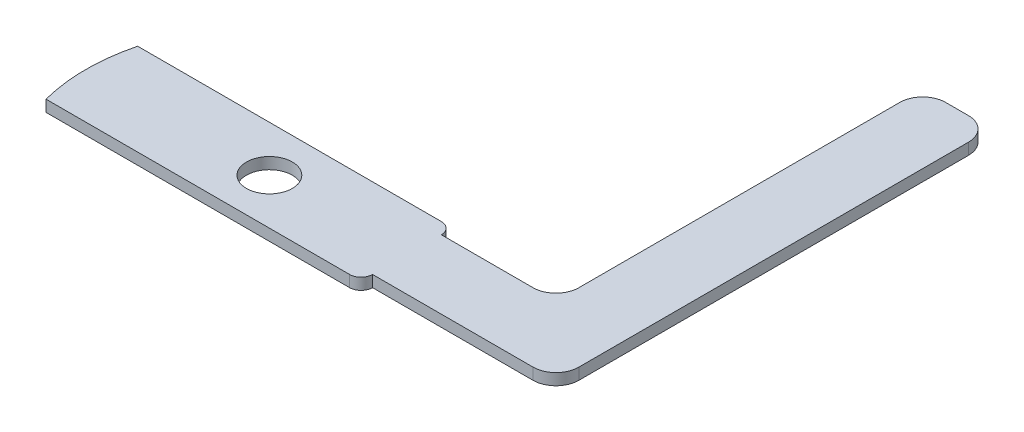
ISO-10303-21;
HEADER;
FILE_DESCRIPTION(('STEP AP214'),'2;1');
FILE_NAME('part.step','',(''),(''),'','','');
FILE_SCHEMA(('AUTOMOTIVE_DESIGN { 1 0 10303 214 1 1 1 1 }'));
ENDSEC;
DATA;
#1=APPLICATION_CONTEXT('core data for automotive mechanical design processes');
#2=APPLICATION_PROTOCOL_DEFINITION('international standard','automotive_design',2000,#1);
#3=PRODUCT_CONTEXT('',#1,'mechanical');
#4=PRODUCT('Part','Part','',(#3));
#5=PRODUCT_RELATED_PRODUCT_CATEGORY('part','',(#4));
#6=PRODUCT_DEFINITION_FORMATION('','',#4);
#7=PRODUCT_DEFINITION_CONTEXT('part definition',#1,'design');
#8=PRODUCT_DEFINITION('design','',#6,#7);
#9=PRODUCT_DEFINITION_SHAPE('','',#8);
#10=(LENGTH_UNIT() NAMED_UNIT(*) SI_UNIT(.MILLI.,.METRE.));
#11=(NAMED_UNIT(*) PLANE_ANGLE_UNIT() SI_UNIT($,.RADIAN.));
#12=(NAMED_UNIT(*) SI_UNIT($,.STERADIAN.) SOLID_ANGLE_UNIT());
#13=UNCERTAINTY_MEASURE_WITH_UNIT(LENGTH_MEASURE(1.E-05),#10,'distance_accuracy_value','');
#14=(GEOMETRIC_REPRESENTATION_CONTEXT(3) GLOBAL_UNCERTAINTY_ASSIGNED_CONTEXT((#13)) GLOBAL_UNIT_ASSIGNED_CONTEXT((#10,
#11,#12)) REPRESENTATION_CONTEXT('',''));
#15=CARTESIAN_POINT('',(0.,0.,0.));
#16=DIRECTION('',(0.,0.,1.));
#17=DIRECTION('',(1.,0.,0.));
#18=AXIS2_PLACEMENT_3D('',#15,#16,#17);
#19=CARTESIAN_POINT('',(0.,1.5875,-12.7));
#20=DIRECTION('',(0.,0.,1.));
#21=DIRECTION('',(1.,0.,0.));
#22=AXIS2_PLACEMENT_3D('',#19,#20,#21);
#23=PLANE('',#22);
#24=DIRECTION('',(-1.,0.,0.));
#25=VECTOR('',#24,1.);
#26=CARTESIAN_POINT('',(0.,1.5875,-12.7));
#27=LINE('',#26,#25);
#28=CARTESIAN_POINT('',(11.1125,1.5875,-12.7));
#29=VERTEX_POINT('',#28);
#30=CARTESIAN_POINT('',(-30.9434442484171,1.5875,-12.7));
#31=VERTEX_POINT('',#30);
#32=EDGE_CURVE('E143',#29,#31,#27,.T.);
#33=ORIENTED_EDGE('',*,*,#32,.F.);
#34=DIRECTION('',(0.,-1.,0.));
#35=VECTOR('',#34,1.);
#36=CARTESIAN_POINT('',(11.1125,0.,-12.7));
#37=LINE('',#36,#35);
#38=CARTESIAN_POINT('',(11.1125,0.,-12.7));
#39=VERTEX_POINT('',#38);
#40=EDGE_CURVE('E11',#29,#39,#37,.T.);
#41=ORIENTED_EDGE('',*,*,#40,.T.);
#42=DIRECTION('',(-1.,0.,0.));
#43=VECTOR('',#42,1.);
#44=CARTESIAN_POINT('',(0.,0.,-12.7));
#45=LINE('',#44,#43);
#46=CARTESIAN_POINT('',(-30.9434442484171,0.,-12.7));
#47=VERTEX_POINT('',#46);
#48=EDGE_CURVE('E165',#39,#47,#45,.T.);
#49=ORIENTED_EDGE('',*,*,#48,.T.);
#50=DIRECTION('',(0.,-1.,0.));
#51=VECTOR('',#50,1.);
#52=CARTESIAN_POINT('',(-30.9434442484171,1.5875,-12.7));
#53=LINE('',#52,#51);
#54=EDGE_CURVE('E158',#31,#47,#53,.T.);
#55=ORIENTED_EDGE('',*,*,#54,.F.);
#56=EDGE_LOOP('',(#33,#41,#49,#55));
#57=FACE_BOUND('',#56,.T.);
#58=ADVANCED_FACE('F41',(#57),#23,.F.);
#59=CARTESIAN_POINT('',(-6.35,1.5875,-6.35));
#60=DIRECTION('',(0.,-1.,0.));
#61=DIRECTION('',(0.,0.,-1.));
#62=AXIS2_PLACEMENT_3D('',#59,#60,#61);
#63=CYLINDRICAL_SURFACE('',#62,25.4);
#64=CARTESIAN_POINT('',(-6.35,0.,-6.35));
#65=DIRECTION('',(0.,1.,0.));
#66=DIRECTION('',(0.,0.,1.));
#67=AXIS2_PLACEMENT_3D('',#64,#65,#66);
#68=CIRCLE('',#67,25.4);
#69=CARTESIAN_POINT('',(-30.9434442484171,0.,0.));
#70=VERTEX_POINT('',#69);
#71=EDGE_CURVE('E282',#47,#70,#68,.T.);
#72=ORIENTED_EDGE('',*,*,#71,.T.);
#73=DIRECTION('',(0.,-1.,0.));
#74=VECTOR('',#73,1.);
#75=CARTESIAN_POINT('',(-30.9434442484171,1.5875,0.));
#76=LINE('',#75,#74);
#77=CARTESIAN_POINT('',(-30.9434442484171,1.5875,0.));
#78=VERTEX_POINT('',#77);
#79=EDGE_CURVE('E160',#78,#70,#76,.T.);
#80=ORIENTED_EDGE('',*,*,#79,.F.);
#81=CARTESIAN_POINT('',(-6.35,1.5875,-6.35));
#82=DIRECTION('',(0.,1.,0.));
#83=DIRECTION('',(0.,0.,1.));
#84=AXIS2_PLACEMENT_3D('',#81,#82,#83);
#85=CIRCLE('',#84,25.4);
#86=EDGE_CURVE('E146',#31,#78,#85,.T.);
#87=ORIENTED_EDGE('',*,*,#86,.F.);
#88=ORIENTED_EDGE('',*,*,#54,.T.);
#89=EDGE_LOOP('',(#72,#80,#87,#88));
#90=FACE_BOUND('',#89,.T.);
#91=ADVANCED_FACE('F157',(#90),#63,.T.);
#92=CARTESIAN_POINT('',(0.,1.5875,0.));
#93=DIRECTION('',(0.,0.,1.));
#94=DIRECTION('',(1.,0.,0.));
#95=AXIS2_PLACEMENT_3D('',#92,#93,#94);
#96=PLANE('',#95);
#97=DIRECTION('',(-1.,0.,0.));
#98=VECTOR('',#97,1.);
#99=CARTESIAN_POINT('',(0.,0.,0.));
#100=LINE('',#99,#98);
#101=CARTESIAN_POINT('',(11.1125,0.,0.));
#102=VERTEX_POINT('',#101);
#103=EDGE_CURVE('E279',#102,#70,#100,.T.);
#104=ORIENTED_EDGE('',*,*,#103,.F.);
#105=DIRECTION('',(0.,-1.,0.));
#106=VECTOR('',#105,1.);
#107=CARTESIAN_POINT('',(11.1125,1.5875,0.));
#108=LINE('',#107,#106);
#109=CARTESIAN_POINT('',(11.1125,1.5875,0.));
#110=VERTEX_POINT('',#109);
#111=EDGE_CURVE('E65',#102,#110,#108,.F.);
#112=ORIENTED_EDGE('',*,*,#111,.T.);
#113=DIRECTION('',(-1.,0.,0.));
#114=VECTOR('',#113,1.);
#115=CARTESIAN_POINT('',(0.,1.5875,0.));
#116=LINE('',#115,#114);
#117=EDGE_CURVE('E162',#110,#78,#116,.T.);
#118=ORIENTED_EDGE('',*,*,#117,.T.);
#119=ORIENTED_EDGE('',*,*,#79,.T.);
#120=EDGE_LOOP('',(#104,#112,#118,#119));
#121=FACE_BOUND('',#120,.T.);
#122=ADVANCED_FACE('F331',(#121),#96,.T.);
#123=CARTESIAN_POINT('',(0.,1.5875,-1.58749999999999));
#124=DIRECTION('',(0.,0.,1.));
#125=DIRECTION('',(1.,0.,0.));
#126=AXIS2_PLACEMENT_3D('',#123,#124,#125);
#127=PLANE('',#126);
#128=DIRECTION('',(-1.,0.,0.));
#129=VECTOR('',#128,1.);
#130=CARTESIAN_POINT('',(0.,0.,-1.58749999999999));
#131=LINE('',#130,#129);
#132=CARTESIAN_POINT('',(34.925,0.,-1.5875));
#133=VERTEX_POINT('',#132);
#134=CARTESIAN_POINT('',(12.7,0.,-1.5875));
#135=VERTEX_POINT('',#134);
#136=EDGE_CURVE('E276',#133,#135,#131,.T.);
#137=ORIENTED_EDGE('',*,*,#136,.F.);
#138=DIRECTION('',(0.,-1.,0.));
#139=VECTOR('',#138,1.);
#140=CARTESIAN_POINT('',(34.925,1.5875,-1.5875));
#141=LINE('',#140,#139);
#142=CARTESIAN_POINT('',(34.925,1.5875,-1.5875));
#143=VERTEX_POINT('',#142);
#144=EDGE_CURVE('E217',#133,#143,#141,.F.);
#145=ORIENTED_EDGE('',*,*,#144,.T.);
#146=DIRECTION('',(-1.,0.,0.));
#147=VECTOR('',#146,1.);
#148=CARTESIAN_POINT('',(0.,1.5875,-1.58749999999999));
#149=LINE('',#148,#147);
#150=CARTESIAN_POINT('',(12.7,1.5875,-1.5875));
#151=VERTEX_POINT('',#150);
#152=EDGE_CURVE('E239',#143,#151,#149,.T.);
#153=ORIENTED_EDGE('',*,*,#152,.T.);
#154=DIRECTION('',(0.,-1.,0.));
#155=VECTOR('',#154,1.);
#156=CARTESIAN_POINT('',(12.7,1.5875,-1.5875));
#157=LINE('',#156,#155);
#158=EDGE_CURVE('E174',#151,#135,#157,.T.);
#159=ORIENTED_EDGE('',*,*,#158,.T.);
#160=EDGE_LOOP('',(#137,#145,#153,#159));
#161=FACE_BOUND('',#160,.T.);
#162=ADVANCED_FACE('F246',(#161),#127,.T.);
#163=CARTESIAN_POINT('',(38.1,1.5875,0.));
#164=DIRECTION('',(1.,0.,0.));
#165=DIRECTION('',(0.,0.,-1.));
#166=AXIS2_PLACEMENT_3D('',#163,#164,#165);
#167=PLANE('',#166);
#168=DIRECTION('',(0.,0.,1.));
#169=VECTOR('',#168,1.);
#170=CARTESIAN_POINT('',(38.1,0.,0.));
#171=LINE('',#170,#169);
#172=CARTESIAN_POINT('',(38.1,0.,-58.7375));
#173=VERTEX_POINT('',#172);
#174=CARTESIAN_POINT('',(38.1,0.,-4.7625));
#175=VERTEX_POINT('',#174);
#176=EDGE_CURVE('E272',#173,#175,#171,.T.);
#177=ORIENTED_EDGE('',*,*,#176,.F.);
#178=DIRECTION('',(0.,-1.,0.));
#179=VECTOR('',#178,1.);
#180=CARTESIAN_POINT('',(38.1,1.5875,-58.7375));
#181=LINE('',#180,#179);
#182=CARTESIAN_POINT('',(38.1,1.5875,-58.7375));
#183=VERTEX_POINT('',#182);
#184=EDGE_CURVE('E194',#173,#183,#181,.F.);
#185=ORIENTED_EDGE('',*,*,#184,.T.);
#186=DIRECTION('',(0.,0.,1.));
#187=VECTOR('',#186,1.);
#188=CARTESIAN_POINT('',(38.1,1.5875,0.));
#189=LINE('',#188,#187);
#190=CARTESIAN_POINT('',(38.1,1.5875,-4.7625));
#191=VERTEX_POINT('',#190);
#192=EDGE_CURVE('E249',#183,#191,#189,.T.);
#193=ORIENTED_EDGE('',*,*,#192,.T.);
#194=DIRECTION('',(0.,-1.,0.));
#195=VECTOR('',#194,1.);
#196=CARTESIAN_POINT('',(38.1,1.5875,-4.7625));
#197=LINE('',#196,#195);
#198=EDGE_CURVE('E190',#191,#175,#197,.T.);
#199=ORIENTED_EDGE('',*,*,#198,.T.);
#200=EDGE_LOOP('',(#177,#185,#193,#199));
#201=FACE_BOUND('',#200,.T.);
#202=ADVANCED_FACE('F362',(#201),#167,.T.);
#203=CARTESIAN_POINT('',(0.,1.5875,-61.9125));
#204=DIRECTION('',(0.,0.,1.));
#205=DIRECTION('',(1.,0.,0.));
#206=AXIS2_PLACEMENT_3D('',#203,#204,#205);
#207=PLANE('',#206);
#208=DIRECTION('',(-1.,0.,0.));
#209=VECTOR('',#208,1.);
#210=CARTESIAN_POINT('',(0.,1.5875,-61.9125));
#211=LINE('',#210,#209);
#212=CARTESIAN_POINT('',(34.925,1.5875,-61.9125));
#213=VERTEX_POINT('',#212);
#214=CARTESIAN_POINT('',(31.75,1.5875,-61.9125));
#215=VERTEX_POINT('',#214);
#216=EDGE_CURVE('E298',#213,#215,#211,.T.);
#217=ORIENTED_EDGE('',*,*,#216,.F.);
#218=DIRECTION('',(0.,-1.,0.));
#219=VECTOR('',#218,1.);
#220=CARTESIAN_POINT('',(34.925,0.,-61.9125));
#221=LINE('',#220,#219);
#222=CARTESIAN_POINT('',(34.925,0.,-61.9125));
#223=VERTEX_POINT('',#222);
#224=EDGE_CURVE('E172',#213,#223,#221,.T.);
#225=ORIENTED_EDGE('',*,*,#224,.T.);
#226=DIRECTION('',(-1.,0.,0.));
#227=VECTOR('',#226,1.);
#228=CARTESIAN_POINT('',(0.,0.,-61.9125));
#229=LINE('',#228,#227);
#230=CARTESIAN_POINT('',(31.75,0.,-61.9125));
#231=VERTEX_POINT('',#230);
#232=EDGE_CURVE('E268',#223,#231,#229,.T.);
#233=ORIENTED_EDGE('',*,*,#232,.T.);
#234=DIRECTION('',(0.,-1.,0.));
#235=VECTOR('',#234,1.);
#236=CARTESIAN_POINT('',(31.75,1.5875,-61.9125));
#237=LINE('',#236,#235);
#238=EDGE_CURVE('E168',#231,#215,#237,.F.);
#239=ORIENTED_EDGE('',*,*,#238,.T.);
#240=EDGE_LOOP('',(#217,#225,#233,#239));
#241=FACE_BOUND('',#240,.T.);
#242=ADVANCED_FACE('F367',(#241),#207,.F.);
#243=CARTESIAN_POINT('',(28.575,1.5875,0.));
#244=DIRECTION('',(1.,0.,0.));
#245=DIRECTION('',(0.,0.,-1.));
#246=AXIS2_PLACEMENT_3D('',#243,#244,#245);
#247=PLANE('',#246);
#248=DIRECTION('',(0.,0.,1.));
#249=VECTOR('',#248,1.);
#250=CARTESIAN_POINT('',(28.575,1.5875,0.));
#251=LINE('',#250,#249);
#252=CARTESIAN_POINT('',(28.575,1.5875,-58.7375));
#253=VERTEX_POINT('',#252);
#254=CARTESIAN_POINT('',(28.575,1.5875,-14.2875));
#255=VERTEX_POINT('',#254);
#256=EDGE_CURVE('E294',#253,#255,#251,.T.);
#257=ORIENTED_EDGE('',*,*,#256,.F.);
#258=DIRECTION('',(0.,-1.,0.));
#259=VECTOR('',#258,1.);
#260=CARTESIAN_POINT('',(28.575,1.5875,-58.7375));
#261=LINE('',#260,#259);
#262=CARTESIAN_POINT('',(28.575,0.,-58.7375));
#263=VERTEX_POINT('',#262);
#264=EDGE_CURVE('E209',#253,#263,#261,.T.);
#265=ORIENTED_EDGE('',*,*,#264,.T.);
#266=DIRECTION('',(0.,0.,1.));
#267=VECTOR('',#266,1.);
#268=CARTESIAN_POINT('',(28.575,0.,0.));
#269=LINE('',#268,#267);
#270=CARTESIAN_POINT('',(28.575,0.,-14.2875));
#271=VERTEX_POINT('',#270);
#272=EDGE_CURVE('E264',#263,#271,#269,.T.);
#273=ORIENTED_EDGE('',*,*,#272,.T.);
#274=DIRECTION('',(0.,-1.,0.));
#275=VECTOR('',#274,1.);
#276=CARTESIAN_POINT('',(28.575,1.5875,-14.2875));
#277=LINE('',#276,#275);
#278=EDGE_CURVE('E206',#271,#255,#277,.F.);
#279=ORIENTED_EDGE('',*,*,#278,.T.);
#280=EDGE_LOOP('',(#257,#265,#273,#279));
#281=FACE_BOUND('',#280,.T.);
#282=ADVANCED_FACE('F371',(#281),#247,.F.);
#283=CARTESIAN_POINT('',(0.,1.5875,-11.1125));
#284=DIRECTION('',(0.,0.,-1.));
#285=DIRECTION('',(-1.,0.,0.));
#286=AXIS2_PLACEMENT_3D('',#283,#284,#285);
#287=PLANE('',#286);
#288=DIRECTION('',(1.,0.,0.));
#289=VECTOR('',#288,1.);
#290=CARTESIAN_POINT('',(0.,1.5875,-11.1125));
#291=LINE('',#290,#289);
#292=CARTESIAN_POINT('',(12.7,1.5875,-11.1125));
#293=VERTEX_POINT('',#292);
#294=CARTESIAN_POINT('',(25.4,1.5875,-11.1125));
#295=VERTEX_POINT('',#294);
#296=EDGE_CURVE('E257',#293,#295,#291,.T.);
#297=ORIENTED_EDGE('',*,*,#296,.T.);
#298=DIRECTION('',(0.,-1.,0.));
#299=VECTOR('',#298,1.);
#300=CARTESIAN_POINT('',(25.4,1.5875,-11.1125));
#301=LINE('',#300,#299);
#302=CARTESIAN_POINT('',(25.4,0.,-11.1125));
#303=VERTEX_POINT('',#302);
#304=EDGE_CURVE('E213',#295,#303,#301,.T.);
#305=ORIENTED_EDGE('',*,*,#304,.T.);
#306=DIRECTION('',(1.,0.,0.));
#307=VECTOR('',#306,1.);
#308=CARTESIAN_POINT('',(0.,0.,-11.1125));
#309=LINE('',#308,#307);
#310=CARTESIAN_POINT('',(12.7,0.,-11.1125));
#311=VERTEX_POINT('',#310);
#312=EDGE_CURVE('E260',#311,#303,#309,.T.);
#313=ORIENTED_EDGE('',*,*,#312,.F.);
#314=DIRECTION('',(0.,-1.,0.));
#315=VECTOR('',#314,1.);
#316=CARTESIAN_POINT('',(12.7,1.5875,-11.1125));
#317=LINE('',#316,#315);
#318=EDGE_CURVE('E254',#293,#311,#317,.T.);
#319=ORIENTED_EDGE('',*,*,#318,.F.);
#320=EDGE_LOOP('',(#297,#305,#313,#319));
#321=FACE_BOUND('',#320,.T.);
#322=ADVANCED_FACE('F324',(#321),#287,.T.);
#323=CARTESIAN_POINT('',(-6.35,1.5875,-6.35));
#324=DIRECTION('',(0.,-1.,0.));
#325=DIRECTION('',(0.,0.,-1.));
#326=AXIS2_PLACEMENT_3D('',#323,#324,#325);
#327=CYLINDRICAL_SURFACE('',#326,3.175);
#328=CARTESIAN_POINT('',(-6.35,1.5875,-6.35));
#329=DIRECTION('',(0.,1.,0.));
#330=DIRECTION('',(0.,0.,1.));
#331=AXIS2_PLACEMENT_3D('',#328,#329,#330);
#332=CIRCLE('',#331,3.175);
#333=CARTESIAN_POINT('',(-6.35,1.5875,-3.175));
#334=VERTEX_POINT('',#333);
#335=EDGE_CURVE('E152',#334,#334,#332,.T.);
#336=ORIENTED_EDGE('',*,*,#335,.T.);
#337=EDGE_LOOP('',(#336));
#338=FACE_BOUND('',#337,.T.);
#339=CARTESIAN_POINT('',(-6.35,0.,-6.35));
#340=DIRECTION('',(0.,1.,0.));
#341=DIRECTION('',(0.,0.,1.));
#342=AXIS2_PLACEMENT_3D('',#339,#340,#341);
#343=CIRCLE('',#342,3.175);
#344=CARTESIAN_POINT('',(-6.35,0.,-3.175));
#345=VERTEX_POINT('',#344);
#346=EDGE_CURVE('E287',#345,#345,#343,.T.);
#347=ORIENTED_EDGE('',*,*,#346,.F.);
#348=EDGE_LOOP('',(#347));
#349=FACE_BOUND('',#348,.T.);
#350=ADVANCED_FACE('F311',(#338,#349),#327,.F.);
#351=CARTESIAN_POINT('',(0.,1.5875,0.));
#352=DIRECTION('',(0.,1.,0.));
#353=DIRECTION('',(0.,0.,1.));
#354=AXIS2_PLACEMENT_3D('',#351,#352,#353);
#355=PLANE('',#354);
#356=ORIENTED_EDGE('',*,*,#335,.F.);
#357=EDGE_LOOP('',(#356));
#358=FACE_BOUND('',#357,.T.);
#359=ORIENTED_EDGE('',*,*,#117,.F.);
#360=CARTESIAN_POINT('',(11.1125,1.5875,-1.5875));
#361=DIRECTION('',(0.,1.,0.));
#362=DIRECTION('',(0.,0.,1.));
#363=AXIS2_PLACEMENT_3D('',#360,#361,#362);
#364=CIRCLE('',#363,1.5875);
#365=EDGE_CURVE('E50',#110,#151,#364,.T.);
#366=ORIENTED_EDGE('',*,*,#365,.T.);
#367=ORIENTED_EDGE('',*,*,#152,.F.);
#368=CARTESIAN_POINT('',(34.925,1.5875,-4.7625));
#369=DIRECTION('',(0.,1.,0.));
#370=DIRECTION('',(0.,0.,1.));
#371=AXIS2_PLACEMENT_3D('',#368,#369,#370);
#372=CIRCLE('',#371,3.175);
#373=EDGE_CURVE('E197',#143,#191,#372,.T.);
#374=ORIENTED_EDGE('',*,*,#373,.T.);
#375=ORIENTED_EDGE('',*,*,#192,.F.);
#376=CARTESIAN_POINT('',(34.925,1.5875,-58.7375));
#377=DIRECTION('',(0.,1.,0.));
#378=DIRECTION('',(0.,0.,1.));
#379=AXIS2_PLACEMENT_3D('',#376,#377,#378);
#380=CIRCLE('',#379,3.175);
#381=EDGE_CURVE('E203',#183,#213,#380,.T.);
#382=ORIENTED_EDGE('',*,*,#381,.T.);
#383=ORIENTED_EDGE('',*,*,#216,.T.);
#384=CARTESIAN_POINT('',(31.75,1.5875,-58.7375));
#385=DIRECTION('',(0.,1.,0.));
#386=DIRECTION('',(0.,0.,1.));
#387=AXIS2_PLACEMENT_3D('',#384,#385,#386);
#388=CIRCLE('',#387,3.175);
#389=EDGE_CURVE('E200',#215,#253,#388,.T.);
#390=ORIENTED_EDGE('',*,*,#389,.T.);
#391=ORIENTED_EDGE('',*,*,#256,.T.);
#392=CARTESIAN_POINT('',(25.4,1.5875,-14.2875));
#393=DIRECTION('',(0.,1.,0.));
#394=DIRECTION('',(0.,0.,1.));
#395=AXIS2_PLACEMENT_3D('',#392,#393,#394);
#396=CIRCLE('',#395,3.175);
#397=EDGE_CURVE('E223',#255,#295,#396,.F.);
#398=ORIENTED_EDGE('',*,*,#397,.T.);
#399=ORIENTED_EDGE('',*,*,#296,.F.);
#400=CARTESIAN_POINT('',(11.1125,1.5875,-11.1125));
#401=DIRECTION('',(0.,1.,0.));
#402=DIRECTION('',(0.,0.,1.));
#403=AXIS2_PLACEMENT_3D('',#400,#401,#402);
#404=CIRCLE('',#403,1.5875);
#405=EDGE_CURVE('E57',#293,#29,#404,.T.);
#406=ORIENTED_EDGE('',*,*,#405,.T.);
#407=ORIENTED_EDGE('',*,*,#32,.T.);
#408=ORIENTED_EDGE('',*,*,#86,.T.);
#409=EDGE_LOOP('',(#359,#366,#367,#374,#375,#382,#383,#390,#391,#398,#399,#406,#407,#408));
#410=FACE_BOUND('',#409,.T.);
#411=ADVANCED_FACE('F145',(#358,#410),#355,.T.);
#412=CARTESIAN_POINT('',(0.,0.,0.));
#413=DIRECTION('',(0.,1.,0.));
#414=DIRECTION('',(0.,0.,1.));
#415=AXIS2_PLACEMENT_3D('',#412,#413,#414);
#416=PLANE('',#415);
#417=ORIENTED_EDGE('',*,*,#346,.T.);
#418=EDGE_LOOP('',(#417));
#419=FACE_BOUND('',#418,.T.);
#420=ORIENTED_EDGE('',*,*,#136,.T.);
#421=CARTESIAN_POINT('',(11.1125,0.,-1.5875));
#422=DIRECTION('',(0.,1.,0.));
#423=DIRECTION('',(0.,0.,1.));
#424=AXIS2_PLACEMENT_3D('',#421,#422,#423);
#425=CIRCLE('',#424,1.5875);
#426=EDGE_CURVE('E229',#135,#102,#425,.F.);
#427=ORIENTED_EDGE('',*,*,#426,.T.);
#428=ORIENTED_EDGE('',*,*,#103,.T.);
#429=ORIENTED_EDGE('',*,*,#71,.F.);
#430=ORIENTED_EDGE('',*,*,#48,.F.);
#431=CARTESIAN_POINT('',(11.1125,0.,-11.1125));
#432=DIRECTION('',(0.,1.,0.));
#433=DIRECTION('',(0.,0.,1.));
#434=AXIS2_PLACEMENT_3D('',#431,#432,#433);
#435=CIRCLE('',#434,1.5875);
#436=EDGE_CURVE('E226',#39,#311,#435,.F.);
#437=ORIENTED_EDGE('',*,*,#436,.T.);
#438=ORIENTED_EDGE('',*,*,#312,.T.);
#439=CARTESIAN_POINT('',(25.4,0.,-14.2875));
#440=DIRECTION('',(0.,1.,0.));
#441=DIRECTION('',(0.,0.,1.));
#442=AXIS2_PLACEMENT_3D('',#439,#440,#441);
#443=CIRCLE('',#442,3.175);
#444=EDGE_CURVE('E220',#303,#271,#443,.T.);
#445=ORIENTED_EDGE('',*,*,#444,.T.);
#446=ORIENTED_EDGE('',*,*,#272,.F.);
#447=CARTESIAN_POINT('',(31.75,0.,-58.7375));
#448=DIRECTION('',(0.,1.,0.));
#449=DIRECTION('',(0.,0.,1.));
#450=AXIS2_PLACEMENT_3D('',#447,#448,#449);
#451=CIRCLE('',#450,3.175);
#452=EDGE_CURVE('E184',#263,#231,#451,.F.);
#453=ORIENTED_EDGE('',*,*,#452,.T.);
#454=ORIENTED_EDGE('',*,*,#232,.F.);
#455=CARTESIAN_POINT('',(34.925,0.,-58.7375));
#456=DIRECTION('',(0.,1.,0.));
#457=DIRECTION('',(0.,0.,1.));
#458=AXIS2_PLACEMENT_3D('',#455,#456,#457);
#459=CIRCLE('',#458,3.175);
#460=EDGE_CURVE('E187',#223,#173,#459,.F.);
#461=ORIENTED_EDGE('',*,*,#460,.T.);
#462=ORIENTED_EDGE('',*,*,#176,.T.);
#463=CARTESIAN_POINT('',(34.925,0.,-4.7625));
#464=DIRECTION('',(0.,1.,0.));
#465=DIRECTION('',(0.,0.,1.));
#466=AXIS2_PLACEMENT_3D('',#463,#464,#465);
#467=CIRCLE('',#466,3.175);
#468=EDGE_CURVE('E181',#175,#133,#467,.F.);
#469=ORIENTED_EDGE('',*,*,#468,.T.);
#470=EDGE_LOOP('',(#420,#427,#428,#429,#430,#437,#438,#445,#446,#453,#454,#461,#462,#469));
#471=FACE_BOUND('',#470,.T.);
#472=ADVANCED_FACE('F315',(#419,#471),#416,.F.);
#473=CARTESIAN_POINT('',(34.925,1.5875,-58.7375));
#474=DIRECTION('',(0.,1.,0.));
#475=DIRECTION('',(0.,0.,1.));
#476=AXIS2_PLACEMENT_3D('',#473,#474,#475);
#477=CYLINDRICAL_SURFACE('',#476,3.175);
#478=ORIENTED_EDGE('',*,*,#381,.F.);
#479=ORIENTED_EDGE('',*,*,#184,.F.);
#480=ORIENTED_EDGE('',*,*,#460,.F.);
#481=ORIENTED_EDGE('',*,*,#224,.F.);
#482=EDGE_LOOP('',(#478,#479,#480,#481));
#483=FACE_BOUND('',#482,.T.);
#484=ADVANCED_FACE('F321',(#483),#477,.T.);
#485=CARTESIAN_POINT('',(31.75,1.5875,-58.7375));
#486=DIRECTION('',(0.,-1.,0.));
#487=DIRECTION('',(0.,0.,-1.));
#488=AXIS2_PLACEMENT_3D('',#485,#486,#487);
#489=CYLINDRICAL_SURFACE('',#488,3.175);
#490=ORIENTED_EDGE('',*,*,#389,.F.);
#491=ORIENTED_EDGE('',*,*,#238,.F.);
#492=ORIENTED_EDGE('',*,*,#452,.F.);
#493=ORIENTED_EDGE('',*,*,#264,.F.);
#494=EDGE_LOOP('',(#490,#491,#492,#493));
#495=FACE_BOUND('',#494,.T.);
#496=ADVANCED_FACE('F337',(#495),#489,.T.);
#497=CARTESIAN_POINT('',(25.4,1.5875,-14.2875));
#498=DIRECTION('',(0.,-1.,0.));
#499=DIRECTION('',(0.,0.,-1.));
#500=AXIS2_PLACEMENT_3D('',#497,#498,#499);
#501=CYLINDRICAL_SURFACE('',#500,3.175);
#502=ORIENTED_EDGE('',*,*,#397,.F.);
#503=ORIENTED_EDGE('',*,*,#278,.F.);
#504=ORIENTED_EDGE('',*,*,#444,.F.);
#505=ORIENTED_EDGE('',*,*,#304,.F.);
#506=EDGE_LOOP('',(#502,#503,#504,#505));
#507=FACE_BOUND('',#506,.T.);
#508=ADVANCED_FACE('F341',(#507),#501,.F.);
#509=CARTESIAN_POINT('',(34.925,1.5875,-4.7625));
#510=DIRECTION('',(0.,-1.,0.));
#511=DIRECTION('',(0.,0.,-1.));
#512=AXIS2_PLACEMENT_3D('',#509,#510,#511);
#513=CYLINDRICAL_SURFACE('',#512,3.175);
#514=ORIENTED_EDGE('',*,*,#373,.F.);
#515=ORIENTED_EDGE('',*,*,#144,.F.);
#516=ORIENTED_EDGE('',*,*,#468,.F.);
#517=ORIENTED_EDGE('',*,*,#198,.F.);
#518=EDGE_LOOP('',(#514,#515,#516,#517));
#519=FACE_BOUND('',#518,.T.);
#520=ADVANCED_FACE('F345',(#519),#513,.T.);
#521=CARTESIAN_POINT('',(11.1125,1.5875,-1.5875));
#522=DIRECTION('',(0.,-1.,0.));
#523=DIRECTION('',(0.,0.,-1.));
#524=AXIS2_PLACEMENT_3D('',#521,#522,#523);
#525=CYLINDRICAL_SURFACE('',#524,1.5875);
#526=ORIENTED_EDGE('',*,*,#365,.F.);
#527=ORIENTED_EDGE('',*,*,#111,.F.);
#528=ORIENTED_EDGE('',*,*,#426,.F.);
#529=ORIENTED_EDGE('',*,*,#158,.F.);
#530=EDGE_LOOP('',(#526,#527,#528,#529));
#531=FACE_BOUND('',#530,.T.);
#532=ADVANCED_FACE('F251',(#531),#525,.T.);
#533=CARTESIAN_POINT('',(11.1125,1.5875,-11.1125));
#534=DIRECTION('',(0.,1.,0.));
#535=DIRECTION('',(0.,0.,1.));
#536=AXIS2_PLACEMENT_3D('',#533,#534,#535);
#537=CYLINDRICAL_SURFACE('',#536,1.5875);
#538=ORIENTED_EDGE('',*,*,#405,.F.);
#539=ORIENTED_EDGE('',*,*,#318,.T.);
#540=ORIENTED_EDGE('',*,*,#436,.F.);
#541=ORIENTED_EDGE('',*,*,#40,.F.);
#542=EDGE_LOOP('',(#538,#539,#540,#541));
#543=FACE_BOUND('',#542,.T.);
#544=ADVANCED_FACE('F43',(#543),#537,.T.);
#545=CLOSED_SHELL('',(#58,#91,#122,#162,#202,#242,#282,#322,#350,#411,#472,#484,#496,#508,#520,
#532,#544));
#546=MANIFOLD_SOLID_BREP('B2',#545);
#547=ADVANCED_BREP_SHAPE_REPRESENTATION('',(#18,#546),#14);
#548=SHAPE_DEFINITION_REPRESENTATION(#9,#547);
ENDSEC;
END-ISO-10303-21;
